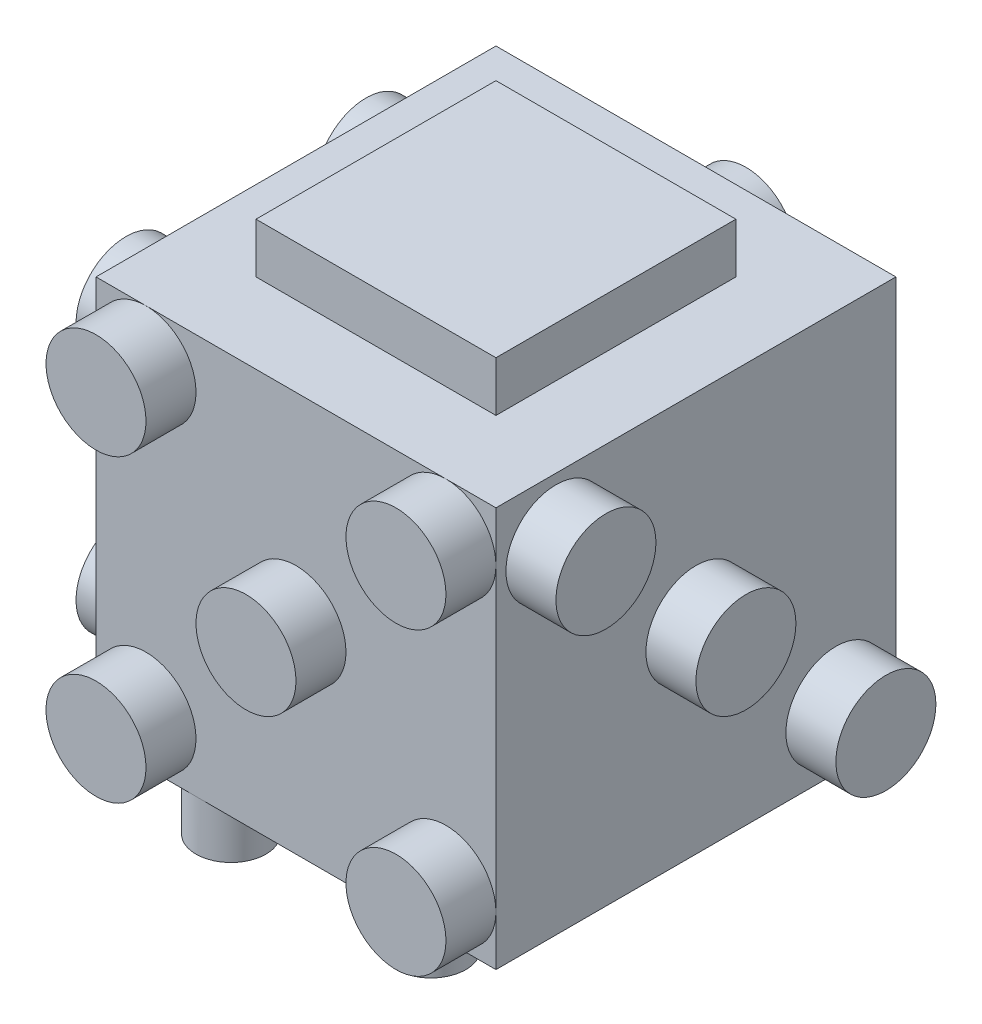
ISO-10303-21;
HEADER;
FILE_DESCRIPTION(('STEP AP214'),'2;1');
FILE_NAME('part.step','',(''),(''),'','','');
FILE_SCHEMA(('AUTOMOTIVE_DESIGN { 1 0 10303 214 1 1 1 1 }'));
ENDSEC;
DATA;
#1=APPLICATION_CONTEXT('core data for automotive mechanical design processes');
#2=APPLICATION_PROTOCOL_DEFINITION('international standard','automotive_design',2000,#1);
#3=PRODUCT_CONTEXT('',#1,'mechanical');
#4=PRODUCT('Part','Part','',(#3));
#5=PRODUCT_RELATED_PRODUCT_CATEGORY('part','',(#4));
#6=PRODUCT_DEFINITION_FORMATION('','',#4);
#7=PRODUCT_DEFINITION_CONTEXT('part definition',#1,'design');
#8=PRODUCT_DEFINITION('design','',#6,#7);
#9=PRODUCT_DEFINITION_SHAPE('','',#8);
#10=(LENGTH_UNIT() NAMED_UNIT(*) SI_UNIT(.MILLI.,.METRE.));
#11=(NAMED_UNIT(*) PLANE_ANGLE_UNIT() SI_UNIT($,.RADIAN.));
#12=(NAMED_UNIT(*) SI_UNIT($,.STERADIAN.) SOLID_ANGLE_UNIT());
#13=UNCERTAINTY_MEASURE_WITH_UNIT(LENGTH_MEASURE(1.E-05),#10,'distance_accuracy_value','');
#14=(GEOMETRIC_REPRESENTATION_CONTEXT(3) GLOBAL_UNCERTAINTY_ASSIGNED_CONTEXT((#13)) GLOBAL_UNIT_ASSIGNED_CONTEXT((#10,
#11,#12)) REPRESENTATION_CONTEXT('',''));
#15=CARTESIAN_POINT('',(0.,0.,0.));
#16=DIRECTION('',(0.,0.,1.));
#17=DIRECTION('',(1.,0.,0.));
#18=AXIS2_PLACEMENT_3D('',#15,#16,#17);
#19=CARTESIAN_POINT('',(0.,2.5,0.));
#20=DIRECTION('',(0.,1.,0.));
#21=DIRECTION('',(0.,0.,1.));
#22=AXIS2_PLACEMENT_3D('',#19,#20,#21);
#23=PLANE('',#22);
#24=CARTESIAN_POINT('',(5.,2.5,8.25));
#25=DIRECTION('',(0.,1.,0.));
#26=DIRECTION('',(0.,0.,1.));
#27=AXIS2_PLACEMENT_3D('',#24,#25,#26);
#28=CIRCLE('',#27,1.75);
#29=CARTESIAN_POINT('',(5.,2.5,10.));
#30=VERTEX_POINT('',#29);
#31=EDGE_CURVE('E57',#30,#30,#28,.F.);
#32=ORIENTED_EDGE('',*,*,#31,.F.);
#33=EDGE_LOOP('',(#32));
#34=FACE_BOUND('',#33,.T.);
#35=ADVANCED_FACE('F50',(#34),#23,.T.);
#36=CARTESIAN_POINT('',(5.,0.,8.25));
#37=DIRECTION('',(0.,-1.,0.));
#38=DIRECTION('',(0.,0.,-1.));
#39=AXIS2_PLACEMENT_3D('',#36,#37,#38);
#40=PLANE('',#39);
#41=CARTESIAN_POINT('',(5.,0.,8.25));
#42=DIRECTION('',(0.,-1.,0.));
#43=DIRECTION('',(0.,0.,-1.));
#44=AXIS2_PLACEMENT_3D('',#41,#42,#43);
#45=CIRCLE('',#44,1.75);
#46=CARTESIAN_POINT('',(5.,0.,6.5));
#47=VERTEX_POINT('',#46);
#48=EDGE_CURVE('E11',#47,#47,#45,.T.);
#49=ORIENTED_EDGE('',*,*,#48,.T.);
#50=EDGE_LOOP('',(#49));
#51=FACE_BOUND('',#50,.T.);
#52=ADVANCED_FACE('F52',(#51),#40,.T.);
#53=CARTESIAN_POINT('',(5.,7.44974746830583,8.25));
#54=DIRECTION('',(0.,-1.,0.));
#55=DIRECTION('',(0.,0.,-1.));
#56=AXIS2_PLACEMENT_3D('',#53,#54,#55);
#57=CYLINDRICAL_SURFACE('',#56,1.75);
#58=ORIENTED_EDGE('',*,*,#48,.F.);
#59=EDGE_LOOP('',(#58));
#60=FACE_BOUND('',#59,.T.);
#61=ORIENTED_EDGE('',*,*,#31,.T.);
#62=EDGE_LOOP('',(#61));
#63=FACE_BOUND('',#62,.T.);
#64=ADVANCED_FACE('F63',(#60,#63),#57,.T.);
#65=CLOSED_SHELL('',(#35,#52,#64));
#66=MANIFOLD_SOLID_BREP('B2',#65);
#67=CARTESIAN_POINT('',(0.,2.5,0.));
#68=DIRECTION('',(0.,1.,0.));
#69=DIRECTION('',(0.,0.,1.));
#70=AXIS2_PLACEMENT_3D('',#67,#68,#69);
#71=PLANE('',#70);
#72=CARTESIAN_POINT('',(5.,2.5,0.));
#73=DIRECTION('',(0.,1.,0.));
#74=DIRECTION('',(0.,0.,1.));
#75=AXIS2_PLACEMENT_3D('',#72,#73,#74);
#76=CIRCLE('',#75,1.75);
#77=CARTESIAN_POINT('',(5.,2.5,1.75));
#78=VERTEX_POINT('',#77);
#79=EDGE_CURVE('E106',#78,#78,#76,.F.);
#80=ORIENTED_EDGE('',*,*,#79,.F.);
#81=EDGE_LOOP('',(#80));
#82=FACE_BOUND('',#81,.T.);
#83=ADVANCED_FACE('F99',(#82),#71,.T.);
#84=CARTESIAN_POINT('',(5.,0.,0.));
#85=DIRECTION('',(0.,-1.,0.));
#86=DIRECTION('',(0.,0.,-1.));
#87=AXIS2_PLACEMENT_3D('',#84,#85,#86);
#88=PLANE('',#87);
#89=CARTESIAN_POINT('',(5.,0.,0.));
#90=DIRECTION('',(0.,-1.,0.));
#91=DIRECTION('',(0.,0.,-1.));
#92=AXIS2_PLACEMENT_3D('',#89,#90,#91);
#93=CIRCLE('',#92,1.75);
#94=CARTESIAN_POINT('',(5.,0.,-1.75));
#95=VERTEX_POINT('',#94);
#96=EDGE_CURVE('E49',#95,#95,#93,.T.);
#97=ORIENTED_EDGE('',*,*,#96,.T.);
#98=EDGE_LOOP('',(#97));
#99=FACE_BOUND('',#98,.T.);
#100=ADVANCED_FACE('F101',(#99),#88,.T.);
#101=CARTESIAN_POINT('',(5.,7.44974746830583,0.));
#102=DIRECTION('',(0.,-1.,0.));
#103=DIRECTION('',(0.,0.,-1.));
#104=AXIS2_PLACEMENT_3D('',#101,#102,#103);
#105=CYLINDRICAL_SURFACE('',#104,1.75);
#106=ORIENTED_EDGE('',*,*,#96,.F.);
#107=EDGE_LOOP('',(#106));
#108=FACE_BOUND('',#107,.T.);
#109=ORIENTED_EDGE('',*,*,#79,.T.);
#110=EDGE_LOOP('',(#109));
#111=FACE_BOUND('',#110,.T.);
#112=ADVANCED_FACE('F112',(#108,#111),#105,.T.);
#113=CLOSED_SHELL('',(#83,#100,#112));
#114=MANIFOLD_SOLID_BREP('B6',#113);
#115=CARTESIAN_POINT('',(0.,2.5,0.));
#116=DIRECTION('',(0.,1.,0.));
#117=DIRECTION('',(0.,0.,1.));
#118=AXIS2_PLACEMENT_3D('',#115,#116,#117);
#119=PLANE('',#118);
#120=CARTESIAN_POINT('',(5.,2.5,-8.25));
#121=DIRECTION('',(0.,1.,0.));
#122=DIRECTION('',(0.,0.,1.));
#123=AXIS2_PLACEMENT_3D('',#120,#121,#122);
#124=CIRCLE('',#123,1.75);
#125=CARTESIAN_POINT('',(5.,2.5,-6.5));
#126=VERTEX_POINT('',#125);
#127=EDGE_CURVE('E155',#126,#126,#124,.F.);
#128=ORIENTED_EDGE('',*,*,#127,.F.);
#129=EDGE_LOOP('',(#128));
#130=FACE_BOUND('',#129,.T.);
#131=ADVANCED_FACE('F148',(#130),#119,.T.);
#132=CARTESIAN_POINT('',(5.,0.,-8.25));
#133=DIRECTION('',(0.,-1.,0.));
#134=DIRECTION('',(0.,0.,-1.));
#135=AXIS2_PLACEMENT_3D('',#132,#133,#134);
#136=PLANE('',#135);
#137=CARTESIAN_POINT('',(5.,0.,-8.25));
#138=DIRECTION('',(0.,-1.,0.));
#139=DIRECTION('',(0.,0.,-1.));
#140=AXIS2_PLACEMENT_3D('',#137,#138,#139);
#141=CIRCLE('',#140,1.75);
#142=CARTESIAN_POINT('',(5.,0.,-10.));
#143=VERTEX_POINT('',#142);
#144=EDGE_CURVE('E98',#143,#143,#141,.T.);
#145=ORIENTED_EDGE('',*,*,#144,.T.);
#146=EDGE_LOOP('',(#145));
#147=FACE_BOUND('',#146,.T.);
#148=ADVANCED_FACE('F150',(#147),#136,.T.);
#149=CARTESIAN_POINT('',(5.,7.44974746830583,-8.25));
#150=DIRECTION('',(0.,-1.,0.));
#151=DIRECTION('',(0.,0.,-1.));
#152=AXIS2_PLACEMENT_3D('',#149,#150,#151);
#153=CYLINDRICAL_SURFACE('',#152,1.75);
#154=ORIENTED_EDGE('',*,*,#144,.F.);
#155=EDGE_LOOP('',(#154));
#156=FACE_BOUND('',#155,.T.);
#157=ORIENTED_EDGE('',*,*,#127,.T.);
#158=EDGE_LOOP('',(#157));
#159=FACE_BOUND('',#158,.T.);
#160=ADVANCED_FACE('F161',(#156,#159),#153,.T.);
#161=CLOSED_SHELL('',(#131,#148,#160));
#162=MANIFOLD_SOLID_BREP('B44',#161);
#163=CARTESIAN_POINT('',(0.,2.5,0.));
#164=DIRECTION('',(0.,1.,0.));
#165=DIRECTION('',(0.,0.,1.));
#166=AXIS2_PLACEMENT_3D('',#163,#164,#165);
#167=PLANE('',#166);
#168=CARTESIAN_POINT('',(-5.,2.5,8.25));
#169=DIRECTION('',(0.,1.,0.));
#170=DIRECTION('',(0.,0.,1.));
#171=AXIS2_PLACEMENT_3D('',#168,#169,#170);
#172=CIRCLE('',#171,1.75);
#173=CARTESIAN_POINT('',(-5.,2.5,10.));
#174=VERTEX_POINT('',#173);
#175=EDGE_CURVE('E204',#174,#174,#172,.F.);
#176=ORIENTED_EDGE('',*,*,#175,.F.);
#177=EDGE_LOOP('',(#176));
#178=FACE_BOUND('',#177,.T.);
#179=ADVANCED_FACE('F197',(#178),#167,.T.);
#180=CARTESIAN_POINT('',(-5.,0.,8.25));
#181=DIRECTION('',(0.,-1.,0.));
#182=DIRECTION('',(0.,0.,-1.));
#183=AXIS2_PLACEMENT_3D('',#180,#181,#182);
#184=PLANE('',#183);
#185=CARTESIAN_POINT('',(-5.,0.,8.25));
#186=DIRECTION('',(0.,-1.,0.));
#187=DIRECTION('',(0.,0.,-1.));
#188=AXIS2_PLACEMENT_3D('',#185,#186,#187);
#189=CIRCLE('',#188,1.75);
#190=CARTESIAN_POINT('',(-5.,0.,6.5));
#191=VERTEX_POINT('',#190);
#192=EDGE_CURVE('E147',#191,#191,#189,.T.);
#193=ORIENTED_EDGE('',*,*,#192,.T.);
#194=EDGE_LOOP('',(#193));
#195=FACE_BOUND('',#194,.T.);
#196=ADVANCED_FACE('F199',(#195),#184,.T.);
#197=CARTESIAN_POINT('',(-5.,7.44974746830583,8.25));
#198=DIRECTION('',(0.,-1.,0.));
#199=DIRECTION('',(0.,0.,-1.));
#200=AXIS2_PLACEMENT_3D('',#197,#198,#199);
#201=CYLINDRICAL_SURFACE('',#200,1.75);
#202=ORIENTED_EDGE('',*,*,#192,.F.);
#203=EDGE_LOOP('',(#202));
#204=FACE_BOUND('',#203,.T.);
#205=ORIENTED_EDGE('',*,*,#175,.T.);
#206=EDGE_LOOP('',(#205));
#207=FACE_BOUND('',#206,.T.);
#208=ADVANCED_FACE('F210',(#204,#207),#201,.T.);
#209=CLOSED_SHELL('',(#179,#196,#208));
#210=MANIFOLD_SOLID_BREP('B93',#209);
#211=CARTESIAN_POINT('',(0.,2.5,0.));
#212=DIRECTION('',(0.,1.,0.));
#213=DIRECTION('',(0.,0.,1.));
#214=AXIS2_PLACEMENT_3D('',#211,#212,#213);
#215=PLANE('',#214);
#216=CARTESIAN_POINT('',(-5.,2.5,0.));
#217=DIRECTION('',(0.,1.,0.));
#218=DIRECTION('',(0.,0.,1.));
#219=AXIS2_PLACEMENT_3D('',#216,#217,#218);
#220=CIRCLE('',#219,1.75);
#221=CARTESIAN_POINT('',(-5.,2.5,1.75));
#222=VERTEX_POINT('',#221);
#223=EDGE_CURVE('E253',#222,#222,#220,.F.);
#224=ORIENTED_EDGE('',*,*,#223,.F.);
#225=EDGE_LOOP('',(#224));
#226=FACE_BOUND('',#225,.T.);
#227=ADVANCED_FACE('F246',(#226),#215,.T.);
#228=CARTESIAN_POINT('',(-5.,0.,0.));
#229=DIRECTION('',(0.,-1.,0.));
#230=DIRECTION('',(0.,0.,-1.));
#231=AXIS2_PLACEMENT_3D('',#228,#229,#230);
#232=PLANE('',#231);
#233=CARTESIAN_POINT('',(-5.,0.,0.));
#234=DIRECTION('',(0.,-1.,0.));
#235=DIRECTION('',(0.,0.,-1.));
#236=AXIS2_PLACEMENT_3D('',#233,#234,#235);
#237=CIRCLE('',#236,1.75);
#238=CARTESIAN_POINT('',(-5.,0.,-1.75));
#239=VERTEX_POINT('',#238);
#240=EDGE_CURVE('E196',#239,#239,#237,.T.);
#241=ORIENTED_EDGE('',*,*,#240,.T.);
#242=EDGE_LOOP('',(#241));
#243=FACE_BOUND('',#242,.T.);
#244=ADVANCED_FACE('F248',(#243),#232,.T.);
#245=CARTESIAN_POINT('',(-5.,7.44974746830583,0.));
#246=DIRECTION('',(0.,-1.,0.));
#247=DIRECTION('',(0.,0.,-1.));
#248=AXIS2_PLACEMENT_3D('',#245,#246,#247);
#249=CYLINDRICAL_SURFACE('',#248,1.75);
#250=ORIENTED_EDGE('',*,*,#240,.F.);
#251=EDGE_LOOP('',(#250));
#252=FACE_BOUND('',#251,.T.);
#253=ORIENTED_EDGE('',*,*,#223,.T.);
#254=EDGE_LOOP('',(#253));
#255=FACE_BOUND('',#254,.T.);
#256=ADVANCED_FACE('F259',(#252,#255),#249,.T.);
#257=CLOSED_SHELL('',(#227,#244,#256));
#258=MANIFOLD_SOLID_BREP('B142',#257);
#259=CARTESIAN_POINT('',(0.,2.5,0.));
#260=DIRECTION('',(0.,1.,0.));
#261=DIRECTION('',(0.,0.,1.));
#262=AXIS2_PLACEMENT_3D('',#259,#260,#261);
#263=PLANE('',#262);
#264=CARTESIAN_POINT('',(-5.,2.5,-8.25));
#265=DIRECTION('',(0.,1.,0.));
#266=DIRECTION('',(0.,0.,1.));
#267=AXIS2_PLACEMENT_3D('',#264,#265,#266);
#268=CIRCLE('',#267,1.75);
#269=CARTESIAN_POINT('',(-5.,2.5,-6.5));
#270=VERTEX_POINT('',#269);
#271=EDGE_CURVE('E245',#270,#270,#268,.F.);
#272=ORIENTED_EDGE('',*,*,#271,.F.);
#273=EDGE_LOOP('',(#272));
#274=FACE_BOUND('',#273,.T.);
#275=ADVANCED_FACE('F296',(#274),#263,.T.);
#276=CARTESIAN_POINT('',(-5.,0.,-8.25));
#277=DIRECTION('',(0.,-1.,0.));
#278=DIRECTION('',(0.,0.,-1.));
#279=AXIS2_PLACEMENT_3D('',#276,#277,#278);
#280=PLANE('',#279);
#281=CARTESIAN_POINT('',(-5.,0.,-8.25));
#282=DIRECTION('',(0.,-1.,0.));
#283=DIRECTION('',(0.,0.,-1.));
#284=AXIS2_PLACEMENT_3D('',#281,#282,#283);
#285=CIRCLE('',#284,1.75);
#286=CARTESIAN_POINT('',(-5.,0.,-10.));
#287=VERTEX_POINT('',#286);
#288=EDGE_CURVE('E302',#287,#287,#285,.T.);
#289=ORIENTED_EDGE('',*,*,#288,.T.);
#290=EDGE_LOOP('',(#289));
#291=FACE_BOUND('',#290,.T.);
#292=ADVANCED_FACE('F308',(#291),#280,.T.);
#293=CARTESIAN_POINT('',(-5.,7.44974746830583,-8.25));
#294=DIRECTION('',(0.,-1.,0.));
#295=DIRECTION('',(0.,0.,-1.));
#296=AXIS2_PLACEMENT_3D('',#293,#294,#295);
#297=CYLINDRICAL_SURFACE('',#296,1.75);
#298=ORIENTED_EDGE('',*,*,#288,.F.);
#299=EDGE_LOOP('',(#298));
#300=FACE_BOUND('',#299,.T.);
#301=ORIENTED_EDGE('',*,*,#271,.T.);
#302=EDGE_LOOP('',(#301));
#303=FACE_BOUND('',#302,.T.);
#304=ADVANCED_FACE('F310',(#300,#303),#297,.T.);
#305=CLOSED_SHELL('',(#275,#292,#304));
#306=MANIFOLD_SOLID_BREP('B191',#305);
#307=CARTESIAN_POINT('',(0.,22.5,0.));
#308=DIRECTION('',(0.,1.,0.));
#309=DIRECTION('',(0.,0.,1.));
#310=AXIS2_PLACEMENT_3D('',#307,#308,#309);
#311=PLANE('',#310);
#312=DIRECTION('',(0.,0.,-1.));
#313=VECTOR('',#312,1.);
#314=CARTESIAN_POINT('',(10.,22.5,-10.));
#315=LINE('',#314,#313);
#316=CARTESIAN_POINT('',(10.,22.5,10.));
#317=VERTEX_POINT('',#316);
#318=CARTESIAN_POINT('',(10.,22.5,-10.));
#319=VERTEX_POINT('',#318);
#320=EDGE_CURVE('E572',#317,#319,#315,.T.);
#321=ORIENTED_EDGE('',*,*,#320,.T.);
#322=DIRECTION('',(-1.,0.,0.));
#323=VECTOR('',#322,1.);
#324=CARTESIAN_POINT('',(-10.,22.5,-10.));
#325=LINE('',#324,#323);
#326=CARTESIAN_POINT('',(-10.,22.5,-10.));
#327=VERTEX_POINT('',#326);
#328=EDGE_CURVE('E576',#319,#327,#325,.T.);
#329=ORIENTED_EDGE('',*,*,#328,.T.);
#330=DIRECTION('',(0.,0.,1.));
#331=VECTOR('',#330,1.);
#332=CARTESIAN_POINT('',(-10.,22.5,-10.));
#333=LINE('',#332,#331);
#334=CARTESIAN_POINT('',(-10.,22.5,10.));
#335=VERTEX_POINT('',#334);
#336=EDGE_CURVE('E580',#327,#335,#333,.T.);
#337=ORIENTED_EDGE('',*,*,#336,.T.);
#338=DIRECTION('',(1.,0.,0.));
#339=VECTOR('',#338,1.);
#340=CARTESIAN_POINT('',(-10.,22.5,10.));
#341=LINE('',#340,#339);
#342=CARTESIAN_POINT('',(-7.5,22.5,10.));
#343=VERTEX_POINT('',#342);
#344=EDGE_CURVE('E584',#335,#343,#341,.T.);
#345=ORIENTED_EDGE('',*,*,#344,.T.);
#346=CARTESIAN_POINT('',(7.5,22.5,10.));
#347=VERTEX_POINT('',#346);
#348=EDGE_CURVE('E589',#343,#347,#341,.T.);
#349=ORIENTED_EDGE('',*,*,#348,.T.);
#350=EDGE_CURVE('E583',#347,#317,#341,.T.);
#351=ORIENTED_EDGE('',*,*,#350,.T.);
#352=EDGE_LOOP('',(#321,#329,#337,#345,#349,#351));
#353=FACE_BOUND('',#352,.T.);
#354=DIRECTION('',(0.,0.,-1.));
#355=VECTOR('',#354,1.);
#356=CARTESIAN_POINT('',(-6.,22.5,-6.));
#357=LINE('',#356,#355);
#358=CARTESIAN_POINT('',(-6.,22.5,6.));
#359=VERTEX_POINT('',#358);
#360=CARTESIAN_POINT('',(-6.,22.5,-6.));
#361=VERTEX_POINT('',#360);
#362=EDGE_CURVE('E474',#359,#361,#357,.T.);
#363=ORIENTED_EDGE('',*,*,#362,.T.);
#364=DIRECTION('',(-1.,0.,0.));
#365=VECTOR('',#364,1.);
#366=CARTESIAN_POINT('',(-6.,22.5,-6.));
#367=LINE('',#366,#365);
#368=CARTESIAN_POINT('',(6.,22.5,-6.));
#369=VERTEX_POINT('',#368);
#370=EDGE_CURVE('E356',#369,#361,#367,.T.);
#371=ORIENTED_EDGE('',*,*,#370,.F.);
#372=DIRECTION('',(0.,0.,-1.));
#373=VECTOR('',#372,1.);
#374=CARTESIAN_POINT('',(6.,22.5,-6.));
#375=LINE('',#374,#373);
#376=CARTESIAN_POINT('',(6.,22.5,6.));
#377=VERTEX_POINT('',#376);
#378=EDGE_CURVE('E360',#377,#369,#375,.T.);
#379=ORIENTED_EDGE('',*,*,#378,.F.);
#380=DIRECTION('',(-1.,0.,0.));
#381=VECTOR('',#380,1.);
#382=CARTESIAN_POINT('',(-6.,22.5,6.));
#383=LINE('',#382,#381);
#384=EDGE_CURVE('E437',#377,#359,#383,.T.);
#385=ORIENTED_EDGE('',*,*,#384,.T.);
#386=EDGE_LOOP('',(#363,#371,#379,#385));
#387=FACE_BOUND('',#386,.T.);
#388=ADVANCED_FACE('F337',(#353,#387),#311,.T.);
#389=CARTESIAN_POINT('',(-10.,22.5,10.));
#390=DIRECTION('',(0.,0.,-1.));
#391=DIRECTION('',(-1.,0.,0.));
#392=AXIS2_PLACEMENT_3D('',#389,#390,#391);
#393=PLANE('',#392);
#394=DIRECTION('',(0.,-1.,0.));
#395=VECTOR('',#394,1.);
#396=CARTESIAN_POINT('',(10.,22.5,10.));
#397=LINE('',#396,#395);
#398=CARTESIAN_POINT('',(10.,5.,10.));
#399=VERTEX_POINT('',#398);
#400=CARTESIAN_POINT('',(10.,2.5,10.));
#401=VERTEX_POINT('',#400);
#402=EDGE_CURVE('E588',#399,#401,#397,.T.);
#403=ORIENTED_EDGE('',*,*,#402,.F.);
#404=CARTESIAN_POINT('',(7.5,5.,10.));
#405=DIRECTION('',(0.,0.,-1.));
#406=DIRECTION('',(-1.,0.,0.));
#407=AXIS2_PLACEMENT_3D('',#404,#405,#406);
#408=CIRCLE('',#407,2.5);
#409=CARTESIAN_POINT('',(7.5,2.5,10.));
#410=VERTEX_POINT('',#409);
#411=EDGE_CURVE('E534',#410,#399,#408,.F.);
#412=ORIENTED_EDGE('',*,*,#411,.F.);
#413=DIRECTION('',(1.,0.,0.));
#414=VECTOR('',#413,1.);
#415=CARTESIAN_POINT('',(-10.,2.5,10.));
#416=LINE('',#415,#414);
#417=EDGE_CURVE('E600',#410,#401,#416,.T.);
#418=ORIENTED_EDGE('',*,*,#417,.T.);
#419=EDGE_LOOP('',(#403,#412,#418));
#420=FACE_BOUND('',#419,.T.);
#421=ADVANCED_FACE('F704',(#420),#393,.F.);
#422=CARTESIAN_POINT('',(0.,12.5,10.));
#423=DIRECTION('',(0.,0.,-1.));
#424=DIRECTION('',(-1.,0.,0.));
#425=AXIS2_PLACEMENT_3D('',#422,#423,#424);
#426=CIRCLE('',#425,2.5);
#427=CARTESIAN_POINT('',(-2.5,12.5,10.));
#428=VERTEX_POINT('',#427);
#429=EDGE_CURVE('E549',#428,#428,#426,.F.);
#430=ORIENTED_EDGE('',*,*,#429,.F.);
#431=EDGE_LOOP('',(#430));
#432=FACE_BOUND('',#431,.T.);
#433=CARTESIAN_POINT('',(-7.5,2.5,10.));
#434=VERTEX_POINT('',#433);
#435=EDGE_CURVE('E604',#434,#410,#416,.T.);
#436=ORIENTED_EDGE('',*,*,#435,.T.);
#437=EDGE_CURVE('E533',#399,#410,#408,.F.);
#438=ORIENTED_EDGE('',*,*,#437,.F.);
#439=CARTESIAN_POINT('',(10.,20.,10.));
#440=VERTEX_POINT('',#439);
#441=EDGE_CURVE('E610',#440,#399,#397,.T.);
#442=ORIENTED_EDGE('',*,*,#441,.F.);
#443=CARTESIAN_POINT('',(7.5,20.,10.));
#444=DIRECTION('',(0.,0.,-1.));
#445=DIRECTION('',(-1.,0.,0.));
#446=AXIS2_PLACEMENT_3D('',#443,#444,#445);
#447=CIRCLE('',#446,2.5);
#448=EDGE_CURVE('E557',#347,#440,#447,.F.);
#449=ORIENTED_EDGE('',*,*,#448,.F.);
#450=ORIENTED_EDGE('',*,*,#348,.F.);
#451=CARTESIAN_POINT('',(-7.5,20.,10.));
#452=DIRECTION('',(0.,0.,-1.));
#453=DIRECTION('',(-1.,0.,0.));
#454=AXIS2_PLACEMENT_3D('',#451,#452,#453);
#455=CIRCLE('',#454,2.5);
#456=CARTESIAN_POINT('',(-10.,20.,10.));
#457=VERTEX_POINT('',#456);
#458=EDGE_CURVE('E349',#457,#343,#455,.F.);
#459=ORIENTED_EDGE('',*,*,#458,.F.);
#460=DIRECTION('',(0.,-1.,0.));
#461=VECTOR('',#460,1.);
#462=CARTESIAN_POINT('',(-10.,22.5,10.));
#463=LINE('',#462,#461);
#464=CARTESIAN_POINT('',(-10.,5.,10.));
#465=VERTEX_POINT('',#464);
#466=EDGE_CURVE('E615',#457,#465,#463,.T.);
#467=ORIENTED_EDGE('',*,*,#466,.T.);
#468=CARTESIAN_POINT('',(-7.5,5.,10.));
#469=DIRECTION('',(0.,0.,-1.));
#470=DIRECTION('',(-1.,0.,0.));
#471=AXIS2_PLACEMENT_3D('',#468,#469,#470);
#472=CIRCLE('',#471,2.5);
#473=EDGE_CURVE('E541',#434,#465,#472,.F.);
#474=ORIENTED_EDGE('',*,*,#473,.F.);
#475=EDGE_LOOP('',(#436,#438,#442,#449,#450,#459,#467,#474));
#476=FACE_BOUND('',#475,.T.);
#477=ADVANCED_FACE('F658',(#432,#476),#393,.F.);
#478=ORIENTED_EDGE('',*,*,#350,.F.);
#479=EDGE_CURVE('E558',#440,#347,#447,.F.);
#480=ORIENTED_EDGE('',*,*,#479,.F.);
#481=EDGE_CURVE('E605',#317,#440,#397,.T.);
#482=ORIENTED_EDGE('',*,*,#481,.F.);
#483=EDGE_LOOP('',(#478,#480,#482));
#484=FACE_BOUND('',#483,.T.);
#485=ADVANCED_FACE('F653',(#484),#393,.F.);
#486=CARTESIAN_POINT('',(-10.,2.5,10.));
#487=VERTEX_POINT('',#486);
#488=EDGE_CURVE('E577',#487,#434,#416,.T.);
#489=ORIENTED_EDGE('',*,*,#488,.T.);
#490=EDGE_CURVE('E542',#465,#434,#472,.F.);
#491=ORIENTED_EDGE('',*,*,#490,.F.);
#492=EDGE_CURVE('E609',#465,#487,#463,.T.);
#493=ORIENTED_EDGE('',*,*,#492,.T.);
#494=EDGE_LOOP('',(#489,#491,#493));
#495=FACE_BOUND('',#494,.T.);
#496=ADVANCED_FACE('F721',(#495),#393,.F.);
#497=CARTESIAN_POINT('',(10.,22.5,-10.));
#498=DIRECTION('',(-1.,0.,0.));
#499=DIRECTION('',(0.,0.,1.));
#500=AXIS2_PLACEMENT_3D('',#497,#498,#499);
#501=PLANE('',#500);
#502=CARTESIAN_POINT('',(10.,19.5,7.));
#503=DIRECTION('',(-1.,0.,0.));
#504=DIRECTION('',(0.,0.,1.));
#505=AXIS2_PLACEMENT_3D('',#502,#503,#504);
#506=CIRCLE('',#505,2.5);
#507=CARTESIAN_POINT('',(10.,19.5,9.5));
#508=VERTEX_POINT('',#507);
#509=EDGE_CURVE('E477',#508,#508,#506,.F.);
#510=ORIENTED_EDGE('',*,*,#509,.F.);
#511=EDGE_LOOP('',(#510));
#512=FACE_BOUND('',#511,.T.);
#513=CARTESIAN_POINT('',(10.,12.5,0.));
#514=DIRECTION('',(-1.,0.,0.));
#515=DIRECTION('',(0.,0.,1.));
#516=AXIS2_PLACEMENT_3D('',#513,#514,#515);
#517=CIRCLE('',#516,2.5);
#518=CARTESIAN_POINT('',(10.,12.5,2.5));
#519=VERTEX_POINT('',#518);
#520=EDGE_CURVE('E485',#519,#519,#517,.F.);
#521=ORIENTED_EDGE('',*,*,#520,.F.);
#522=EDGE_LOOP('',(#521));
#523=FACE_BOUND('',#522,.T.);
#524=CARTESIAN_POINT('',(10.,5.5,-7.));
#525=DIRECTION('',(-1.,0.,0.));
#526=DIRECTION('',(0.,0.,1.));
#527=AXIS2_PLACEMENT_3D('',#524,#525,#526);
#528=CIRCLE('',#527,2.5);
#529=CARTESIAN_POINT('',(10.,5.5,-4.5));
#530=VERTEX_POINT('',#529);
#531=EDGE_CURVE('E497',#530,#530,#528,.F.);
#532=ORIENTED_EDGE('',*,*,#531,.F.);
#533=EDGE_LOOP('',(#532));
#534=FACE_BOUND('',#533,.T.);
#535=DIRECTION('',(0.,0.,-1.));
#536=VECTOR('',#535,1.);
#537=CARTESIAN_POINT('',(10.,2.5,-10.));
#538=LINE('',#537,#536);
#539=CARTESIAN_POINT('',(10.,2.5,-10.));
#540=VERTEX_POINT('',#539);
#541=EDGE_CURVE('E571',#401,#540,#538,.T.);
#542=ORIENTED_EDGE('',*,*,#541,.T.);
#543=DIRECTION('',(0.,-1.,0.));
#544=VECTOR('',#543,1.);
#545=CARTESIAN_POINT('',(10.,22.5,-10.));
#546=LINE('',#545,#544);
#547=EDGE_CURVE('E347',#319,#540,#546,.T.);
#548=ORIENTED_EDGE('',*,*,#547,.F.);
#549=ORIENTED_EDGE('',*,*,#320,.F.);
#550=ORIENTED_EDGE('',*,*,#481,.T.);
#551=ORIENTED_EDGE('',*,*,#441,.T.);
#552=ORIENTED_EDGE('',*,*,#402,.T.);
#553=EDGE_LOOP('',(#542,#548,#549,#550,#551,#552));
#554=FACE_BOUND('',#553,.T.);
#555=ADVANCED_FACE('F339',(#512,#523,#534,#554),#501,.F.);
#556=CARTESIAN_POINT('',(-10.,22.5,-10.));
#557=DIRECTION('',(0.,0.,1.));
#558=DIRECTION('',(1.,0.,0.));
#559=AXIS2_PLACEMENT_3D('',#556,#557,#558);
#560=PLANE('',#559);
#561=CARTESIAN_POINT('',(0.,18.5,-10.));
#562=DIRECTION('',(0.,0.,1.));
#563=DIRECTION('',(1.,0.,0.));
#564=AXIS2_PLACEMENT_3D('',#561,#562,#563);
#565=CIRCLE('',#564,2.5);
#566=CARTESIAN_POINT('',(2.5,18.5,-10.));
#567=VERTEX_POINT('',#566);
#568=EDGE_CURVE('E341',#567,#567,#565,.T.);
#569=ORIENTED_EDGE('',*,*,#568,.T.);
#570=EDGE_LOOP('',(#569));
#571=FACE_BOUND('',#570,.T.);
#572=CARTESIAN_POINT('',(0.,6.5,-10.));
#573=DIRECTION('',(0.,0.,1.));
#574=DIRECTION('',(1.,0.,0.));
#575=AXIS2_PLACEMENT_3D('',#572,#573,#574);
#576=CIRCLE('',#575,2.5);
#577=CARTESIAN_POINT('',(2.5,6.5,-10.));
#578=VERTEX_POINT('',#577);
#579=EDGE_CURVE('E454',#578,#578,#576,.T.);
#580=ORIENTED_EDGE('',*,*,#579,.T.);
#581=EDGE_LOOP('',(#580));
#582=FACE_BOUND('',#581,.T.);
#583=DIRECTION('',(-1.,0.,0.));
#584=VECTOR('',#583,1.);
#585=CARTESIAN_POINT('',(-10.,2.5,-10.));
#586=LINE('',#585,#584);
#587=CARTESIAN_POINT('',(-10.,2.5,-10.));
#588=VERTEX_POINT('',#587);
#589=EDGE_CURVE('E593',#540,#588,#586,.T.);
#590=ORIENTED_EDGE('',*,*,#589,.T.);
#591=DIRECTION('',(0.,-1.,0.));
#592=VECTOR('',#591,1.);
#593=CARTESIAN_POINT('',(-10.,22.5,-10.));
#594=LINE('',#593,#592);
#595=EDGE_CURVE('E614',#327,#588,#594,.T.);
#596=ORIENTED_EDGE('',*,*,#595,.F.);
#597=ORIENTED_EDGE('',*,*,#328,.F.);
#598=ORIENTED_EDGE('',*,*,#547,.T.);
#599=EDGE_LOOP('',(#590,#596,#597,#598));
#600=FACE_BOUND('',#599,.T.);
#601=ADVANCED_FACE('F623',(#571,#582,#600),#560,.F.);
#602=CARTESIAN_POINT('',(-10.,22.5,-10.));
#603=DIRECTION('',(1.,0.,0.));
#604=DIRECTION('',(0.,0.,-1.));
#605=AXIS2_PLACEMENT_3D('',#602,#603,#604);
#606=PLANE('',#605);
#607=CARTESIAN_POINT('',(-10.,18.5,-6.));
#608=DIRECTION('',(1.,0.,0.));
#609=DIRECTION('',(0.,0.,-1.));
#610=AXIS2_PLACEMENT_3D('',#607,#608,#609);
#611=CIRCLE('',#610,2.5);
#612=CARTESIAN_POINT('',(-10.,18.5,-8.5));
#613=VERTEX_POINT('',#612);
#614=EDGE_CURVE('E501',#613,#613,#611,.F.);
#615=ORIENTED_EDGE('',*,*,#614,.F.);
#616=EDGE_LOOP('',(#615));
#617=FACE_BOUND('',#616,.T.);
#618=CARTESIAN_POINT('',(-10.,18.5,6.));
#619=DIRECTION('',(1.,0.,0.));
#620=DIRECTION('',(0.,0.,-1.));
#621=AXIS2_PLACEMENT_3D('',#618,#619,#620);
#622=CIRCLE('',#621,2.5);
#623=CARTESIAN_POINT('',(-10.,18.5,3.5));
#624=VERTEX_POINT('',#623);
#625=EDGE_CURVE('E509',#624,#624,#622,.F.);
#626=ORIENTED_EDGE('',*,*,#625,.F.);
#627=EDGE_LOOP('',(#626));
#628=FACE_BOUND('',#627,.T.);
#629=CARTESIAN_POINT('',(-10.,6.5,6.));
#630=DIRECTION('',(1.,0.,0.));
#631=DIRECTION('',(0.,0.,-1.));
#632=AXIS2_PLACEMENT_3D('',#629,#630,#631);
#633=CIRCLE('',#632,2.5);
#634=CARTESIAN_POINT('',(-10.,6.5,3.5));
#635=VERTEX_POINT('',#634);
#636=EDGE_CURVE('E517',#635,#635,#633,.F.);
#637=ORIENTED_EDGE('',*,*,#636,.F.);
#638=EDGE_LOOP('',(#637));
#639=FACE_BOUND('',#638,.T.);
#640=CARTESIAN_POINT('',(-10.,6.5,-6.));
#641=DIRECTION('',(1.,0.,0.));
#642=DIRECTION('',(0.,0.,-1.));
#643=AXIS2_PLACEMENT_3D('',#640,#641,#642);
#644=CIRCLE('',#643,2.5);
#645=CARTESIAN_POINT('',(-10.,6.5,-8.5));
#646=VERTEX_POINT('',#645);
#647=EDGE_CURVE('E529',#646,#646,#644,.F.);
#648=ORIENTED_EDGE('',*,*,#647,.F.);
#649=EDGE_LOOP('',(#648));
#650=FACE_BOUND('',#649,.T.);
#651=DIRECTION('',(0.,0.,1.));
#652=VECTOR('',#651,1.);
#653=CARTESIAN_POINT('',(-10.,2.5,-10.));
#654=LINE('',#653,#652);
#655=EDGE_CURVE('E596',#588,#487,#654,.T.);
#656=ORIENTED_EDGE('',*,*,#655,.T.);
#657=ORIENTED_EDGE('',*,*,#492,.F.);
#658=ORIENTED_EDGE('',*,*,#466,.F.);
#659=EDGE_CURVE('E611',#335,#457,#463,.T.);
#660=ORIENTED_EDGE('',*,*,#659,.F.);
#661=ORIENTED_EDGE('',*,*,#336,.F.);
#662=ORIENTED_EDGE('',*,*,#595,.T.);
#663=EDGE_LOOP('',(#656,#657,#658,#660,#661,#662));
#664=FACE_BOUND('',#663,.T.);
#665=ADVANCED_FACE('F640',(#617,#628,#639,#650,#664),#606,.F.);
#666=EDGE_CURVE('E294',#343,#457,#455,.F.);
#667=ORIENTED_EDGE('',*,*,#666,.F.);
#668=ORIENTED_EDGE('',*,*,#344,.F.);
#669=ORIENTED_EDGE('',*,*,#659,.T.);
#670=EDGE_LOOP('',(#667,#668,#669));
#671=FACE_BOUND('',#670,.T.);
#672=ADVANCED_FACE('F711',(#671),#393,.F.);
#673=CARTESIAN_POINT('',(0.,2.5,0.));
#674=DIRECTION('',(0.,1.,0.));
#675=DIRECTION('',(0.,0.,1.));
#676=AXIS2_PLACEMENT_3D('',#673,#674,#675);
#677=PLANE('',#676);
#678=ORIENTED_EDGE('',*,*,#541,.F.);
#679=ORIENTED_EDGE('',*,*,#417,.F.);
#680=ORIENTED_EDGE('',*,*,#435,.F.);
#681=ORIENTED_EDGE('',*,*,#488,.F.);
#682=ORIENTED_EDGE('',*,*,#655,.F.);
#683=ORIENTED_EDGE('',*,*,#589,.F.);
#684=EDGE_LOOP('',(#678,#679,#680,#681,#682,#683));
#685=FACE_BOUND('',#684,.T.);
#686=ADVANCED_FACE('F633',(#685),#677,.F.);
#687=CARTESIAN_POINT('',(-7.5,20.,12.5));
#688=DIRECTION('',(0.,0.,1.));
#689=DIRECTION('',(1.,0.,0.));
#690=AXIS2_PLACEMENT_3D('',#687,#688,#689);
#691=PLANE('',#690);
#692=CARTESIAN_POINT('',(-7.5,20.,12.5));
#693=DIRECTION('',(0.,0.,1.));
#694=DIRECTION('',(1.,0.,0.));
#695=AXIS2_PLACEMENT_3D('',#692,#693,#694);
#696=CIRCLE('',#695,2.5);
#697=CARTESIAN_POINT('',(-5.,20.,12.5));
#698=VERTEX_POINT('',#697);
#699=EDGE_CURVE('E565',#698,#698,#696,.T.);
#700=ORIENTED_EDGE('',*,*,#699,.T.);
#701=EDGE_LOOP('',(#700));
#702=FACE_BOUND('',#701,.T.);
#703=ADVANCED_FACE('F717',(#702),#691,.T.);
#704=CARTESIAN_POINT('',(-7.5,20.,2.92893218813452));
#705=DIRECTION('',(0.,0.,1.));
#706=DIRECTION('',(1.,0.,0.));
#707=AXIS2_PLACEMENT_3D('',#704,#705,#706);
#708=CYLINDRICAL_SURFACE('',#707,2.5);
#709=ORIENTED_EDGE('',*,*,#699,.F.);
#710=EDGE_LOOP('',(#709));
#711=FACE_BOUND('',#710,.T.);
#712=ORIENTED_EDGE('',*,*,#458,.T.);
#713=ORIENTED_EDGE('',*,*,#666,.T.);
#714=EDGE_LOOP('',(#712,#713));
#715=FACE_BOUND('',#714,.T.);
#716=ADVANCED_FACE('F714',(#711,#715),#708,.T.);
#717=CARTESIAN_POINT('',(7.5,20.,12.5));
#718=DIRECTION('',(0.,0.,1.));
#719=DIRECTION('',(1.,0.,0.));
#720=AXIS2_PLACEMENT_3D('',#717,#718,#719);
#721=PLANE('',#720);
#722=CARTESIAN_POINT('',(7.5,20.,12.5));
#723=DIRECTION('',(0.,0.,1.));
#724=DIRECTION('',(1.,0.,0.));
#725=AXIS2_PLACEMENT_3D('',#722,#723,#724);
#726=CIRCLE('',#725,2.5);
#727=CARTESIAN_POINT('',(10.,20.,12.5));
#728=VERTEX_POINT('',#727);
#729=EDGE_CURVE('E561',#728,#728,#726,.T.);
#730=ORIENTED_EDGE('',*,*,#729,.T.);
#731=EDGE_LOOP('',(#730));
#732=FACE_BOUND('',#731,.T.);
#733=ADVANCED_FACE('F815',(#732),#721,.T.);
#734=CARTESIAN_POINT('',(7.5,20.,2.92893218813452));
#735=DIRECTION('',(0.,0.,1.));
#736=DIRECTION('',(1.,0.,0.));
#737=AXIS2_PLACEMENT_3D('',#734,#735,#736);
#738=CYLINDRICAL_SURFACE('',#737,2.5);
#739=ORIENTED_EDGE('',*,*,#729,.F.);
#740=EDGE_LOOP('',(#739));
#741=FACE_BOUND('',#740,.T.);
#742=ORIENTED_EDGE('',*,*,#479,.T.);
#743=ORIENTED_EDGE('',*,*,#448,.T.);
#744=EDGE_LOOP('',(#742,#743));
#745=FACE_BOUND('',#744,.T.);
#746=ADVANCED_FACE('F811',(#741,#745),#738,.T.);
#747=CARTESIAN_POINT('',(0.,12.5,12.5));
#748=DIRECTION('',(0.,0.,1.));
#749=DIRECTION('',(1.,0.,0.));
#750=AXIS2_PLACEMENT_3D('',#747,#748,#749);
#751=PLANE('',#750);
#752=CARTESIAN_POINT('',(0.,12.5,12.5));
#753=DIRECTION('',(0.,0.,1.));
#754=DIRECTION('',(1.,0.,0.));
#755=AXIS2_PLACEMENT_3D('',#752,#753,#754);
#756=CIRCLE('',#755,2.5);
#757=CARTESIAN_POINT('',(2.5,12.5,12.5));
#758=VERTEX_POINT('',#757);
#759=EDGE_CURVE('E553',#758,#758,#756,.T.);
#760=ORIENTED_EDGE('',*,*,#759,.T.);
#761=EDGE_LOOP('',(#760));
#762=FACE_BOUND('',#761,.T.);
#763=ADVANCED_FACE('F807',(#762),#751,.T.);
#764=CARTESIAN_POINT('',(0.,12.5,2.92893218813452));
#765=DIRECTION('',(0.,0.,1.));
#766=DIRECTION('',(1.,0.,0.));
#767=AXIS2_PLACEMENT_3D('',#764,#765,#766);
#768=CYLINDRICAL_SURFACE('',#767,2.5);
#769=ORIENTED_EDGE('',*,*,#759,.F.);
#770=EDGE_LOOP('',(#769));
#771=FACE_BOUND('',#770,.T.);
#772=ORIENTED_EDGE('',*,*,#429,.T.);
#773=EDGE_LOOP('',(#772));
#774=FACE_BOUND('',#773,.T.);
#775=ADVANCED_FACE('F803',(#771,#774),#768,.T.);
#776=CARTESIAN_POINT('',(-7.5,5.,12.5));
#777=DIRECTION('',(0.,0.,1.));
#778=DIRECTION('',(1.,0.,0.));
#779=AXIS2_PLACEMENT_3D('',#776,#777,#778);
#780=PLANE('',#779);
#781=CARTESIAN_POINT('',(-7.5,5.,12.5));
#782=DIRECTION('',(0.,0.,1.));
#783=DIRECTION('',(1.,0.,0.));
#784=AXIS2_PLACEMENT_3D('',#781,#782,#783);
#785=CIRCLE('',#784,2.5);
#786=CARTESIAN_POINT('',(-5.,5.,12.5));
#787=VERTEX_POINT('',#786);
#788=EDGE_CURVE('E545',#787,#787,#785,.T.);
#789=ORIENTED_EDGE('',*,*,#788,.T.);
#790=EDGE_LOOP('',(#789));
#791=FACE_BOUND('',#790,.T.);
#792=ADVANCED_FACE('F799',(#791),#780,.T.);
#793=CARTESIAN_POINT('',(-7.5,5.,2.92893218813452));
#794=DIRECTION('',(0.,0.,1.));
#795=DIRECTION('',(1.,0.,0.));
#796=AXIS2_PLACEMENT_3D('',#793,#794,#795);
#797=CYLINDRICAL_SURFACE('',#796,2.5);
#798=ORIENTED_EDGE('',*,*,#788,.F.);
#799=EDGE_LOOP('',(#798));
#800=FACE_BOUND('',#799,.T.);
#801=ORIENTED_EDGE('',*,*,#490,.T.);
#802=ORIENTED_EDGE('',*,*,#473,.T.);
#803=EDGE_LOOP('',(#801,#802));
#804=FACE_BOUND('',#803,.T.);
#805=ADVANCED_FACE('F795',(#800,#804),#797,.T.);
#806=CARTESIAN_POINT('',(7.5,5.,12.5));
#807=DIRECTION('',(0.,0.,1.));
#808=DIRECTION('',(1.,0.,0.));
#809=AXIS2_PLACEMENT_3D('',#806,#807,#808);
#810=PLANE('',#809);
#811=CARTESIAN_POINT('',(7.5,5.,12.5));
#812=DIRECTION('',(0.,0.,1.));
#813=DIRECTION('',(1.,0.,0.));
#814=AXIS2_PLACEMENT_3D('',#811,#812,#813);
#815=CIRCLE('',#814,2.5);
#816=CARTESIAN_POINT('',(10.,5.,12.5));
#817=VERTEX_POINT('',#816);
#818=EDGE_CURVE('E537',#817,#817,#815,.T.);
#819=ORIENTED_EDGE('',*,*,#818,.T.);
#820=EDGE_LOOP('',(#819));
#821=FACE_BOUND('',#820,.T.);
#822=ADVANCED_FACE('F791',(#821),#810,.T.);
#823=CARTESIAN_POINT('',(7.5,5.,2.92893218813452));
#824=DIRECTION('',(0.,0.,1.));
#825=DIRECTION('',(1.,0.,0.));
#826=AXIS2_PLACEMENT_3D('',#823,#824,#825);
#827=CYLINDRICAL_SURFACE('',#826,2.5);
#828=ORIENTED_EDGE('',*,*,#818,.F.);
#829=EDGE_LOOP('',(#828));
#830=FACE_BOUND('',#829,.T.);
#831=ORIENTED_EDGE('',*,*,#411,.T.);
#832=ORIENTED_EDGE('',*,*,#437,.T.);
#833=EDGE_LOOP('',(#831,#832));
#834=FACE_BOUND('',#833,.T.);
#835=ADVANCED_FACE('F784',(#830,#834),#827,.T.);
#836=CARTESIAN_POINT('',(-12.5,6.5,-6.));
#837=DIRECTION('',(-1.,0.,0.));
#838=DIRECTION('',(0.,0.,1.));
#839=AXIS2_PLACEMENT_3D('',#836,#837,#838);
#840=PLANE('',#839);
#841=CARTESIAN_POINT('',(-12.5,6.5,-6.));
#842=DIRECTION('',(-1.,0.,0.));
#843=DIRECTION('',(0.,0.,1.));
#844=AXIS2_PLACEMENT_3D('',#841,#842,#843);
#845=CIRCLE('',#844,2.5);
#846=CARTESIAN_POINT('',(-12.5,6.5,-3.5));
#847=VERTEX_POINT('',#846);
#848=EDGE_CURVE('E525',#847,#847,#845,.T.);
#849=ORIENTED_EDGE('',*,*,#848,.T.);
#850=EDGE_LOOP('',(#849));
#851=FACE_BOUND('',#850,.T.);
#852=ADVANCED_FACE('F781',(#851),#840,.T.);
#853=CARTESIAN_POINT('',(-2.92893218813452,6.5,-6.));
#854=DIRECTION('',(-1.,0.,0.));
#855=DIRECTION('',(0.,0.,1.));
#856=AXIS2_PLACEMENT_3D('',#853,#854,#855);
#857=CYLINDRICAL_SURFACE('',#856,2.5);
#858=ORIENTED_EDGE('',*,*,#848,.F.);
#859=EDGE_LOOP('',(#858));
#860=FACE_BOUND('',#859,.T.);
#861=ORIENTED_EDGE('',*,*,#647,.T.);
#862=EDGE_LOOP('',(#861));
#863=FACE_BOUND('',#862,.T.);
#864=ADVANCED_FACE('F779',(#860,#863),#857,.T.);
#865=CARTESIAN_POINT('',(-12.5,6.5,6.));
#866=DIRECTION('',(-1.,0.,0.));
#867=DIRECTION('',(0.,0.,1.));
#868=AXIS2_PLACEMENT_3D('',#865,#866,#867);
#869=PLANE('',#868);
#870=CARTESIAN_POINT('',(-12.5,6.5,6.));
#871=DIRECTION('',(-1.,0.,0.));
#872=DIRECTION('',(0.,0.,1.));
#873=AXIS2_PLACEMENT_3D('',#870,#871,#872);
#874=CIRCLE('',#873,2.5);
#875=CARTESIAN_POINT('',(-12.5,6.5,8.5));
#876=VERTEX_POINT('',#875);
#877=EDGE_CURVE('E521',#876,#876,#874,.T.);
#878=ORIENTED_EDGE('',*,*,#877,.T.);
#879=EDGE_LOOP('',(#878));
#880=FACE_BOUND('',#879,.T.);
#881=ADVANCED_FACE('F775',(#880),#869,.T.);
#882=CARTESIAN_POINT('',(-2.92893218813452,6.5,6.));
#883=DIRECTION('',(-1.,0.,0.));
#884=DIRECTION('',(0.,0.,1.));
#885=AXIS2_PLACEMENT_3D('',#882,#883,#884);
#886=CYLINDRICAL_SURFACE('',#885,2.5);
#887=ORIENTED_EDGE('',*,*,#877,.F.);
#888=EDGE_LOOP('',(#887));
#889=FACE_BOUND('',#888,.T.);
#890=ORIENTED_EDGE('',*,*,#636,.T.);
#891=EDGE_LOOP('',(#890));
#892=FACE_BOUND('',#891,.T.);
#893=ADVANCED_FACE('F771',(#889,#892),#886,.T.);
#894=CARTESIAN_POINT('',(-12.5,18.5,6.));
#895=DIRECTION('',(-1.,0.,0.));
#896=DIRECTION('',(0.,0.,1.));
#897=AXIS2_PLACEMENT_3D('',#894,#895,#896);
#898=PLANE('',#897);
#899=CARTESIAN_POINT('',(-12.5,18.5,6.));
#900=DIRECTION('',(-1.,0.,0.));
#901=DIRECTION('',(0.,0.,1.));
#902=AXIS2_PLACEMENT_3D('',#899,#900,#901);
#903=CIRCLE('',#902,2.5);
#904=CARTESIAN_POINT('',(-12.5,18.5,8.5));
#905=VERTEX_POINT('',#904);
#906=EDGE_CURVE('E513',#905,#905,#903,.T.);
#907=ORIENTED_EDGE('',*,*,#906,.T.);
#908=EDGE_LOOP('',(#907));
#909=FACE_BOUND('',#908,.T.);
#910=ADVANCED_FACE('F767',(#909),#898,.T.);
#911=CARTESIAN_POINT('',(-2.92893218813452,18.5,6.));
#912=DIRECTION('',(-1.,0.,0.));
#913=DIRECTION('',(0.,0.,1.));
#914=AXIS2_PLACEMENT_3D('',#911,#912,#913);
#915=CYLINDRICAL_SURFACE('',#914,2.5);
#916=ORIENTED_EDGE('',*,*,#906,.F.);
#917=EDGE_LOOP('',(#916));
#918=FACE_BOUND('',#917,.T.);
#919=ORIENTED_EDGE('',*,*,#625,.T.);
#920=EDGE_LOOP('',(#919));
#921=FACE_BOUND('',#920,.T.);
#922=ADVANCED_FACE('F763',(#918,#921),#915,.T.);
#923=CARTESIAN_POINT('',(-12.5,18.5,-6.));
#924=DIRECTION('',(-1.,0.,0.));
#925=DIRECTION('',(0.,0.,1.));
#926=AXIS2_PLACEMENT_3D('',#923,#924,#925);
#927=PLANE('',#926);
#928=CARTESIAN_POINT('',(-12.5,18.5,-6.));
#929=DIRECTION('',(-1.,0.,0.));
#930=DIRECTION('',(0.,0.,1.));
#931=AXIS2_PLACEMENT_3D('',#928,#929,#930);
#932=CIRCLE('',#931,2.5);
#933=CARTESIAN_POINT('',(-12.5,18.5,-3.5));
#934=VERTEX_POINT('',#933);
#935=EDGE_CURVE('E505',#934,#934,#932,.T.);
#936=ORIENTED_EDGE('',*,*,#935,.T.);
#937=EDGE_LOOP('',(#936));
#938=FACE_BOUND('',#937,.T.);
#939=ADVANCED_FACE('F759',(#938),#927,.T.);
#940=CARTESIAN_POINT('',(-2.92893218813452,18.5,-6.));
#941=DIRECTION('',(-1.,0.,0.));
#942=DIRECTION('',(0.,0.,1.));
#943=AXIS2_PLACEMENT_3D('',#940,#941,#942);
#944=CYLINDRICAL_SURFACE('',#943,2.5);
#945=ORIENTED_EDGE('',*,*,#935,.F.);
#946=EDGE_LOOP('',(#945));
#947=FACE_BOUND('',#946,.T.);
#948=ORIENTED_EDGE('',*,*,#614,.T.);
#949=EDGE_LOOP('',(#948));
#950=FACE_BOUND('',#949,.T.);
#951=ADVANCED_FACE('F752',(#947,#950),#944,.T.);
#952=CARTESIAN_POINT('',(12.5,5.5,-7.));
#953=DIRECTION('',(1.,0.,0.));
#954=DIRECTION('',(0.,0.,-1.));
#955=AXIS2_PLACEMENT_3D('',#952,#953,#954);
#956=PLANE('',#955);
#957=CARTESIAN_POINT('',(12.5,5.5,-7.));
#958=DIRECTION('',(1.,0.,0.));
#959=DIRECTION('',(0.,0.,-1.));
#960=AXIS2_PLACEMENT_3D('',#957,#958,#959);
#961=CIRCLE('',#960,2.5);
#962=CARTESIAN_POINT('',(12.5,5.5,-9.5));
#963=VERTEX_POINT('',#962);
#964=EDGE_CURVE('E493',#963,#963,#961,.T.);
#965=ORIENTED_EDGE('',*,*,#964,.T.);
#966=EDGE_LOOP('',(#965));
#967=FACE_BOUND('',#966,.T.);
#968=ADVANCED_FACE('F742',(#967),#956,.T.);
#969=CARTESIAN_POINT('',(2.92893218813452,5.5,-7.));
#970=DIRECTION('',(1.,0.,0.));
#971=DIRECTION('',(0.,0.,-1.));
#972=AXIS2_PLACEMENT_3D('',#969,#970,#971);
#973=CYLINDRICAL_SURFACE('',#972,2.5);
#974=ORIENTED_EDGE('',*,*,#964,.F.);
#975=EDGE_LOOP('',(#974));
#976=FACE_BOUND('',#975,.T.);
#977=ORIENTED_EDGE('',*,*,#531,.T.);
#978=EDGE_LOOP('',(#977));
#979=FACE_BOUND('',#978,.T.);
#980=ADVANCED_FACE('F739',(#976,#979),#973,.T.);
#981=CARTESIAN_POINT('',(12.5,12.5,0.));
#982=DIRECTION('',(1.,0.,0.));
#983=DIRECTION('',(0.,0.,-1.));
#984=AXIS2_PLACEMENT_3D('',#981,#982,#983);
#985=PLANE('',#984);
#986=CARTESIAN_POINT('',(12.5,12.5,0.));
#987=DIRECTION('',(1.,0.,0.));
#988=DIRECTION('',(0.,0.,-1.));
#989=AXIS2_PLACEMENT_3D('',#986,#987,#988);
#990=CIRCLE('',#989,2.5);
#991=CARTESIAN_POINT('',(12.5,12.5,-2.5));
#992=VERTEX_POINT('',#991);
#993=EDGE_CURVE('E489',#992,#992,#990,.T.);
#994=ORIENTED_EDGE('',*,*,#993,.T.);
#995=EDGE_LOOP('',(#994));
#996=FACE_BOUND('',#995,.T.);
#997=ADVANCED_FACE('F741',(#996),#985,.T.);
#998=CARTESIAN_POINT('',(2.92893218813452,12.5,0.));
#999=DIRECTION('',(1.,0.,0.));
#1000=DIRECTION('',(0.,0.,-1.));
#1001=AXIS2_PLACEMENT_3D('',#998,#999,#1000);
#1002=CYLINDRICAL_SURFACE('',#1001,2.5);
#1003=ORIENTED_EDGE('',*,*,#993,.F.);
#1004=EDGE_LOOP('',(#1003));
#1005=FACE_BOUND('',#1004,.T.);
#1006=ORIENTED_EDGE('',*,*,#520,.T.);
#1007=EDGE_LOOP('',(#1006));
#1008=FACE_BOUND('',#1007,.T.);
#1009=ADVANCED_FACE('F749',(#1005,#1008),#1002,.T.);
#1010=CARTESIAN_POINT('',(12.5,19.5,7.));
#1011=DIRECTION('',(1.,0.,0.));
#1012=DIRECTION('',(0.,0.,-1.));
#1013=AXIS2_PLACEMENT_3D('',#1010,#1011,#1012);
#1014=PLANE('',#1013);
#1015=CARTESIAN_POINT('',(12.5,19.5,7.));
#1016=DIRECTION('',(1.,0.,0.));
#1017=DIRECTION('',(0.,0.,-1.));
#1018=AXIS2_PLACEMENT_3D('',#1015,#1016,#1017);
#1019=CIRCLE('',#1018,2.5);
#1020=CARTESIAN_POINT('',(12.5,19.5,4.5));
#1021=VERTEX_POINT('',#1020);
#1022=EDGE_CURVE('E481',#1021,#1021,#1019,.T.);
#1023=ORIENTED_EDGE('',*,*,#1022,.T.);
#1024=EDGE_LOOP('',(#1023));
#1025=FACE_BOUND('',#1024,.T.);
#1026=ADVANCED_FACE('F925',(#1025),#1014,.T.);
#1027=CARTESIAN_POINT('',(2.92893218813452,19.5,7.));
#1028=DIRECTION('',(1.,0.,0.));
#1029=DIRECTION('',(0.,0.,-1.));
#1030=AXIS2_PLACEMENT_3D('',#1027,#1028,#1029);
#1031=CYLINDRICAL_SURFACE('',#1030,2.5);
#1032=ORIENTED_EDGE('',*,*,#1022,.F.);
#1033=EDGE_LOOP('',(#1032));
#1034=FACE_BOUND('',#1033,.T.);
#1035=ORIENTED_EDGE('',*,*,#509,.T.);
#1036=EDGE_LOOP('',(#1035));
#1037=FACE_BOUND('',#1036,.T.);
#1038=ADVANCED_FACE('F935',(#1034,#1037),#1031,.T.);
#1039=CARTESIAN_POINT('',(-6.,5.52943725152286,-6.));
#1040=DIRECTION('',(0.,0.,1.));
#1041=DIRECTION('',(1.,0.,0.));
#1042=AXIS2_PLACEMENT_3D('',#1039,#1040,#1041);
#1043=PLANE('',#1042);
#1044=DIRECTION('',(0.,1.,0.));
#1045=VECTOR('',#1044,1.);
#1046=CARTESIAN_POINT('',(6.,5.52943725152286,-6.));
#1047=LINE('',#1046,#1045);
#1048=CARTESIAN_POINT('',(6.,25.,-6.));
#1049=VERTEX_POINT('',#1048);
#1050=EDGE_CURVE('E428',#369,#1049,#1047,.T.);
#1051=ORIENTED_EDGE('',*,*,#1050,.F.);
#1052=ORIENTED_EDGE('',*,*,#370,.T.);
#1053=DIRECTION('',(0.,1.,0.));
#1054=VECTOR('',#1053,1.);
#1055=CARTESIAN_POINT('',(-6.,5.52943725152286,-6.));
#1056=LINE('',#1055,#1054);
#1057=CARTESIAN_POINT('',(-6.,25.,-6.));
#1058=VERTEX_POINT('',#1057);
#1059=EDGE_CURVE('E452',#361,#1058,#1056,.T.);
#1060=ORIENTED_EDGE('',*,*,#1059,.T.);
#1061=DIRECTION('',(1.,0.,0.));
#1062=VECTOR('',#1061,1.);
#1063=CARTESIAN_POINT('',(-6.,25.,-6.));
#1064=LINE('',#1063,#1062);
#1065=EDGE_CURVE('E444',#1058,#1049,#1064,.T.);
#1066=ORIENTED_EDGE('',*,*,#1065,.T.);
#1067=EDGE_LOOP('',(#1051,#1052,#1060,#1066));
#1068=FACE_BOUND('',#1067,.T.);
#1069=ADVANCED_FACE('F450',(#1068),#1043,.F.);
#1070=CARTESIAN_POINT('',(6.,5.52943725152286,-6.));
#1071=DIRECTION('',(-1.,0.,0.));
#1072=DIRECTION('',(0.,0.,1.));
#1073=AXIS2_PLACEMENT_3D('',#1070,#1071,#1072);
#1074=PLANE('',#1073);
#1075=DIRECTION('',(0.,1.,0.));
#1076=VECTOR('',#1075,1.);
#1077=CARTESIAN_POINT('',(6.,5.52943725152286,6.));
#1078=LINE('',#1077,#1076);
#1079=CARTESIAN_POINT('',(6.,25.,6.));
#1080=VERTEX_POINT('',#1079);
#1081=EDGE_CURVE('E438',#377,#1080,#1078,.T.);
#1082=ORIENTED_EDGE('',*,*,#1081,.F.);
#1083=ORIENTED_EDGE('',*,*,#378,.T.);
#1084=ORIENTED_EDGE('',*,*,#1050,.T.);
#1085=DIRECTION('',(0.,0.,1.));
#1086=VECTOR('',#1085,1.);
#1087=CARTESIAN_POINT('',(6.,25.,-6.));
#1088=LINE('',#1087,#1086);
#1089=EDGE_CURVE('E432',#1049,#1080,#1088,.T.);
#1090=ORIENTED_EDGE('',*,*,#1089,.T.);
#1091=EDGE_LOOP('',(#1082,#1083,#1084,#1090));
#1092=FACE_BOUND('',#1091,.T.);
#1093=ADVANCED_FACE('F431',(#1092),#1074,.F.);
#1094=CARTESIAN_POINT('',(-6.,5.52943725152286,6.));
#1095=DIRECTION('',(0.,0.,1.));
#1096=DIRECTION('',(1.,0.,0.));
#1097=AXIS2_PLACEMENT_3D('',#1094,#1095,#1096);
#1098=PLANE('',#1097);
#1099=ORIENTED_EDGE('',*,*,#384,.F.);
#1100=ORIENTED_EDGE('',*,*,#1081,.T.);
#1101=DIRECTION('',(1.,0.,0.));
#1102=VECTOR('',#1101,1.);
#1103=CARTESIAN_POINT('',(-6.,25.,6.));
#1104=LINE('',#1103,#1102);
#1105=CARTESIAN_POINT('',(-6.,25.,6.));
#1106=VERTEX_POINT('',#1105);
#1107=EDGE_CURVE('E447',#1106,#1080,#1104,.T.);
#1108=ORIENTED_EDGE('',*,*,#1107,.F.);
#1109=DIRECTION('',(0.,1.,0.));
#1110=VECTOR('',#1109,1.);
#1111=CARTESIAN_POINT('',(-6.,5.52943725152286,6.));
#1112=LINE('',#1111,#1110);
#1113=EDGE_CURVE('E469',#359,#1106,#1112,.T.);
#1114=ORIENTED_EDGE('',*,*,#1113,.F.);
#1115=EDGE_LOOP('',(#1099,#1100,#1108,#1114));
#1116=FACE_BOUND('',#1115,.T.);
#1117=ADVANCED_FACE('F966',(#1116),#1098,.T.);
#1118=CARTESIAN_POINT('',(-6.,5.52943725152286,-6.));
#1119=DIRECTION('',(-1.,0.,0.));
#1120=DIRECTION('',(0.,0.,1.));
#1121=AXIS2_PLACEMENT_3D('',#1118,#1119,#1120);
#1122=PLANE('',#1121);
#1123=ORIENTED_EDGE('',*,*,#362,.F.);
#1124=ORIENTED_EDGE('',*,*,#1113,.T.);
#1125=DIRECTION('',(0.,0.,1.));
#1126=VECTOR('',#1125,1.);
#1127=CARTESIAN_POINT('',(-6.,25.,-6.));
#1128=LINE('',#1127,#1126);
#1129=EDGE_CURVE('E464',#1058,#1106,#1128,.T.);
#1130=ORIENTED_EDGE('',*,*,#1129,.F.);
#1131=ORIENTED_EDGE('',*,*,#1059,.F.);
#1132=EDGE_LOOP('',(#1123,#1124,#1130,#1131));
#1133=FACE_BOUND('',#1132,.T.);
#1134=ADVANCED_FACE('F975',(#1133),#1122,.T.);
#1135=CARTESIAN_POINT('',(0.,25.,0.));
#1136=DIRECTION('',(0.,-1.,0.));
#1137=DIRECTION('',(0.,0.,-1.));
#1138=AXIS2_PLACEMENT_3D('',#1135,#1136,#1137);
#1139=PLANE('',#1138);
#1140=ORIENTED_EDGE('',*,*,#1065,.F.);
#1141=ORIENTED_EDGE('',*,*,#1129,.T.);
#1142=ORIENTED_EDGE('',*,*,#1107,.T.);
#1143=ORIENTED_EDGE('',*,*,#1089,.F.);
#1144=EDGE_LOOP('',(#1140,#1141,#1142,#1143));
#1145=FACE_BOUND('',#1144,.T.);
#1146=ADVANCED_FACE('F442',(#1145),#1139,.F.);
#1147=CARTESIAN_POINT('',(0.,6.5,-2.5));
#1148=DIRECTION('',(0.,0.,-1.));
#1149=DIRECTION('',(-1.,0.,0.));
#1150=AXIS2_PLACEMENT_3D('',#1147,#1148,#1149);
#1151=CYLINDRICAL_SURFACE('',#1150,2.5);
#1152=CARTESIAN_POINT('',(0.,6.5,-12.5));
#1153=DIRECTION('',(0.,0.,-1.));
#1154=DIRECTION('',(-1.,0.,0.));
#1155=AXIS2_PLACEMENT_3D('',#1152,#1153,#1154);
#1156=CIRCLE('',#1155,2.5);
#1157=CARTESIAN_POINT('',(-2.5,6.5,-12.5));
#1158=VERTEX_POINT('',#1157);
#1159=EDGE_CURVE('E458',#1158,#1158,#1156,.T.);
#1160=ORIENTED_EDGE('',*,*,#1159,.F.);
#1161=EDGE_LOOP('',(#1160));
#1162=FACE_BOUND('',#1161,.T.);
#1163=ORIENTED_EDGE('',*,*,#579,.F.);
#1164=EDGE_LOOP('',(#1163));
#1165=FACE_BOUND('',#1164,.T.);
#1166=ADVANCED_FACE('F700',(#1162,#1165),#1151,.T.);
#1167=CARTESIAN_POINT('',(0.,0.,-12.5));
#1168=DIRECTION('',(0.,0.,-1.));
#1169=DIRECTION('',(-1.,0.,0.));
#1170=AXIS2_PLACEMENT_3D('',#1167,#1168,#1169);
#1171=PLANE('',#1170);
#1172=ORIENTED_EDGE('',*,*,#1159,.T.);
#1173=EDGE_LOOP('',(#1172));
#1174=FACE_BOUND('',#1173,.T.);
#1175=ADVANCED_FACE('F692',(#1174),#1171,.T.);
#1176=CARTESIAN_POINT('',(0.,18.5,-2.5));
#1177=DIRECTION('',(0.,0.,-1.));
#1178=DIRECTION('',(-1.,0.,0.));
#1179=AXIS2_PLACEMENT_3D('',#1176,#1177,#1178);
#1180=CYLINDRICAL_SURFACE('',#1179,2.5);
#1181=CARTESIAN_POINT('',(0.,18.5,-12.5));
#1182=DIRECTION('',(0.,0.,-1.));
#1183=DIRECTION('',(-1.,0.,0.));
#1184=AXIS2_PLACEMENT_3D('',#1181,#1182,#1183);
#1185=CIRCLE('',#1184,2.5);
#1186=CARTESIAN_POINT('',(-2.5,18.5,-12.5));
#1187=VERTEX_POINT('',#1186);
#1188=EDGE_CURVE('E678',#1187,#1187,#1185,.T.);
#1189=ORIENTED_EDGE('',*,*,#1188,.F.);
#1190=EDGE_LOOP('',(#1189));
#1191=FACE_BOUND('',#1190,.T.);
#1192=ORIENTED_EDGE('',*,*,#568,.F.);
#1193=EDGE_LOOP('',(#1192));
#1194=FACE_BOUND('',#1193,.T.);
#1195=ADVANCED_FACE('F689',(#1191,#1194),#1180,.T.);
#1196=CARTESIAN_POINT('',(0.,18.5,-12.5));
#1197=DIRECTION('',(0.,0.,-1.));
#1198=DIRECTION('',(-1.,0.,0.));
#1199=AXIS2_PLACEMENT_3D('',#1196,#1197,#1198);
#1200=PLANE('',#1199);
#1201=ORIENTED_EDGE('',*,*,#1188,.T.);
#1202=EDGE_LOOP('',(#1201));
#1203=FACE_BOUND('',#1202,.T.);
#1204=ADVANCED_FACE('F691',(#1203),#1200,.T.);
#1205=CLOSED_SHELL('',(#388,#421,#477,#485,#496,#555,#601,#665,#672,#686,#703,#716,#733,#746,
#763,#775,#792,#805,#822,#835,#852,#864,#881,#893,#910,#922,#939,#951,#968,#980,#997,#1009,
#1026,#1038,#1069,#1093,#1117,#1134,#1146,#1166,#1175,#1195,#1204));
#1206=MANIFOLD_SOLID_BREP('B240',#1205);
#1207=ADVANCED_BREP_SHAPE_REPRESENTATION('',(#18,#66,#114,#162,#210,#258,#306,#1206),#14);
#1208=SHAPE_DEFINITION_REPRESENTATION(#9,#1207);
ENDSEC;
END-ISO-10303-21;
